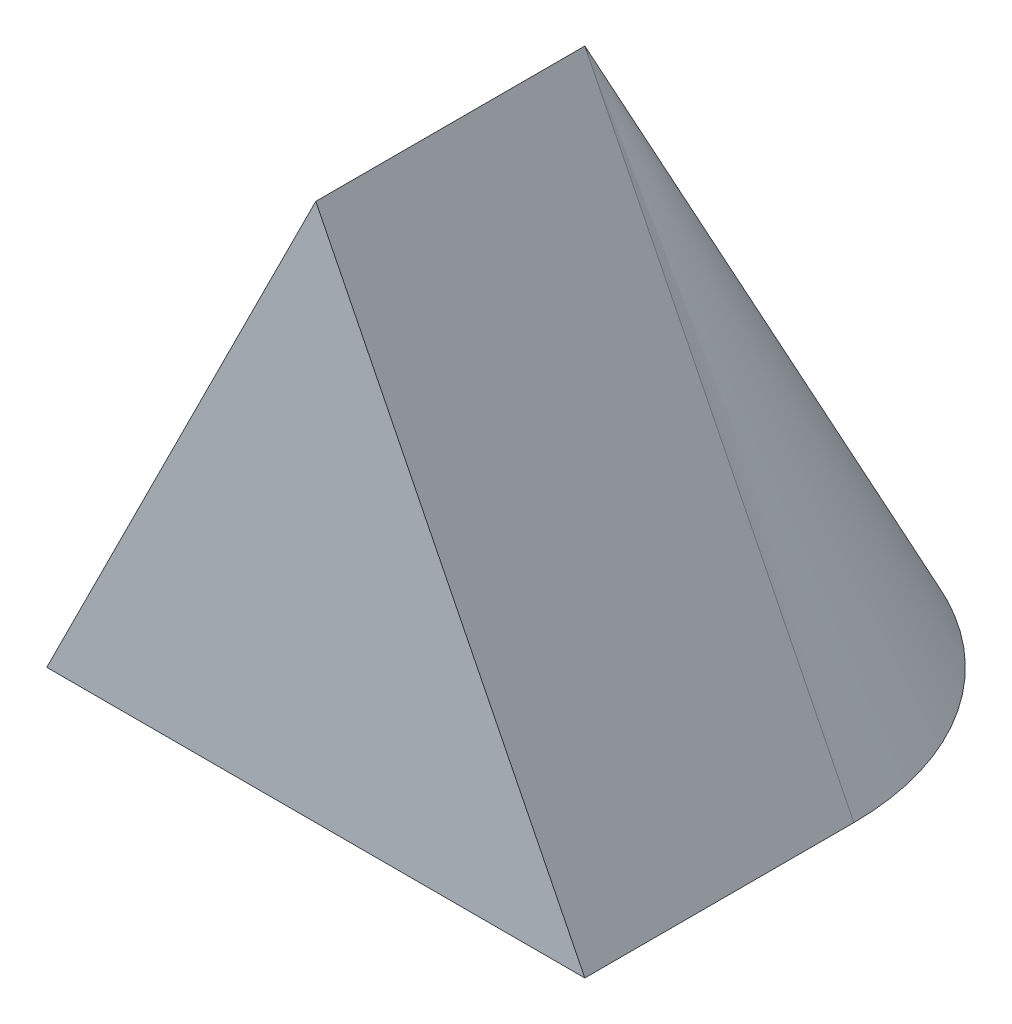
ISO-10303-21;
HEADER;
FILE_DESCRIPTION(('STEP AP214'),'2;1');
FILE_NAME('part.step','',(''),(''),'','','');
FILE_SCHEMA(('AUTOMOTIVE_DESIGN { 1 0 10303 214 1 1 1 1 }'));
ENDSEC;
DATA;
#1=APPLICATION_CONTEXT('core data for automotive mechanical design processes');
#2=APPLICATION_PROTOCOL_DEFINITION('international standard','automotive_design',2000,#1);
#3=PRODUCT_CONTEXT('',#1,'mechanical');
#4=PRODUCT('Part','Part','',(#3));
#5=PRODUCT_RELATED_PRODUCT_CATEGORY('part','',(#4));
#6=PRODUCT_DEFINITION_FORMATION('','',#4);
#7=PRODUCT_DEFINITION_CONTEXT('part definition',#1,'design');
#8=PRODUCT_DEFINITION('design','',#6,#7);
#9=PRODUCT_DEFINITION_SHAPE('','',#8);
#10=(LENGTH_UNIT() NAMED_UNIT(*) SI_UNIT(.MILLI.,.METRE.));
#11=(NAMED_UNIT(*) PLANE_ANGLE_UNIT() SI_UNIT($,.RADIAN.));
#12=(NAMED_UNIT(*) SI_UNIT($,.STERADIAN.) SOLID_ANGLE_UNIT());
#13=UNCERTAINTY_MEASURE_WITH_UNIT(LENGTH_MEASURE(1.E-05),#10,'distance_accuracy_value','');
#14=(GEOMETRIC_REPRESENTATION_CONTEXT(3) GLOBAL_UNCERTAINTY_ASSIGNED_CONTEXT((#13)) GLOBAL_UNIT_ASSIGNED_CONTEXT((#10,
#11,#12)) REPRESENTATION_CONTEXT('',''));
#15=CARTESIAN_POINT('',(0.,0.,0.));
#16=DIRECTION('',(0.,0.,1.));
#17=DIRECTION('',(1.,0.,0.));
#18=AXIS2_PLACEMENT_3D('',#15,#16,#17);
#19=CARTESIAN_POINT('',(0.,136.525,0.));
#20=DIRECTION('',(0.,-1.,0.));
#21=DIRECTION('',(0.,0.,-1.));
#22=AXIS2_PLACEMENT_3D('',#19,#20,#21);
#23=CONICAL_SURFACE('',#22,0.,0.463647609000806);
#24=CARTESIAN_POINT('',(0.,-66.675,0.));
#25=DIRECTION('',(0.,1.,0.));
#26=DIRECTION('',(0.,0.,1.));
#27=AXIS2_PLACEMENT_3D('',#24,#25,#26);
#28=CIRCLE('',#27,101.6);
#29=CARTESIAN_POINT('',(101.6,-66.675,0.));
#30=VERTEX_POINT('',#29);
#31=CARTESIAN_POINT('',(-101.6,-66.675,0.));
#32=VERTEX_POINT('',#31);
#33=EDGE_CURVE('E11',#30,#32,#28,.T.);
#34=ORIENTED_EDGE('',*,*,#33,.T.);
#35=DIRECTION('',(-0.447213595499958,-0.894427190999916,0.));
#36=VECTOR('',#35,1.);
#37=CARTESIAN_POINT('',(0.,136.525,0.));
#38=LINE('',#37,#36);
#39=CARTESIAN_POINT('',(0.,136.525,0.));
#40=VERTEX_POINT('',#39);
#41=EDGE_CURVE('E87',#40,#32,#38,.T.);
#42=ORIENTED_EDGE('',*,*,#41,.F.);
#43=DIRECTION('',(0.447213595499958,-0.894427190999916,0.));
#44=VECTOR('',#43,1.);
#45=CARTESIAN_POINT('',(0.,136.525,0.));
#46=LINE('',#45,#44);
#47=EDGE_CURVE('E45',#40,#30,#46,.T.);
#48=ORIENTED_EDGE('',*,*,#47,.T.);
#49=EDGE_LOOP('',(#34,#42,#48));
#50=FACE_BOUND('',#49,.T.);
#51=ADVANCED_FACE('F38',(#50),#23,.T.);
#52=CARTESIAN_POINT('',(101.6,-66.675,7.09469008052925E-13));
#53=DIRECTION('',(0.,-1.,0.));
#54=DIRECTION('',(0.,0.,-1.));
#55=AXIS2_PLACEMENT_3D('',#52,#53,#54);
#56=PLANE('',#55);
#57=ORIENTED_EDGE('',*,*,#33,.F.);
#58=DIRECTION('',(0.,0.,-1.));
#59=VECTOR('',#58,1.);
#60=CARTESIAN_POINT('',(101.6,-66.675,101.6));
#61=LINE('',#60,#59);
#62=CARTESIAN_POINT('',(101.6,-66.675,101.6));
#63=VERTEX_POINT('',#62);
#64=EDGE_CURVE('E73',#63,#30,#61,.T.);
#65=ORIENTED_EDGE('',*,*,#64,.F.);
#66=DIRECTION('',(1.,0.,0.));
#67=VECTOR('',#66,1.);
#68=CARTESIAN_POINT('',(-101.6,-66.675,101.6));
#69=LINE('',#68,#67);
#70=CARTESIAN_POINT('',(-101.6,-66.675,101.6));
#71=VERTEX_POINT('',#70);
#72=EDGE_CURVE('E60',#71,#63,#69,.T.);
#73=ORIENTED_EDGE('',*,*,#72,.F.);
#74=DIRECTION('',(0.,0.,-1.));
#75=VECTOR('',#74,1.);
#76=CARTESIAN_POINT('',(-101.6,-66.675,101.6));
#77=LINE('',#76,#75);
#78=EDGE_CURVE('E52',#71,#32,#77,.T.);
#79=ORIENTED_EDGE('',*,*,#78,.T.);
#80=EDGE_LOOP('',(#57,#65,#73,#79));
#81=FACE_BOUND('',#80,.T.);
#82=ADVANCED_FACE('F93',(#81),#56,.T.);
#83=CARTESIAN_POINT('',(101.6,-66.675,101.6));
#84=DIRECTION('',(-0.894427190999916,-0.447213595499958,0.));
#85=DIRECTION('',(0.447213595499958,-0.894427190999916,0.));
#86=AXIS2_PLACEMENT_3D('',#83,#84,#85);
#87=PLANE('',#86);
#88=ORIENTED_EDGE('',*,*,#47,.F.);
#89=DIRECTION('',(0.,0.,-1.));
#90=VECTOR('',#89,1.);
#91=CARTESIAN_POINT('',(0.,136.525,101.6));
#92=LINE('',#91,#90);
#93=CARTESIAN_POINT('',(0.,136.525,101.6));
#94=VERTEX_POINT('',#93);
#95=EDGE_CURVE('E79',#94,#40,#92,.T.);
#96=ORIENTED_EDGE('',*,*,#95,.F.);
#97=DIRECTION('',(-0.447213595499958,0.894427190999916,0.));
#98=VECTOR('',#97,1.);
#99=CARTESIAN_POINT('',(101.6,-66.675,101.6));
#100=LINE('',#99,#98);
#101=EDGE_CURVE('E80',#63,#94,#100,.T.);
#102=ORIENTED_EDGE('',*,*,#101,.F.);
#103=ORIENTED_EDGE('',*,*,#64,.T.);
#104=EDGE_LOOP('',(#88,#96,#102,#103));
#105=FACE_BOUND('',#104,.T.);
#106=ADVANCED_FACE('F84',(#105),#87,.F.);
#107=CARTESIAN_POINT('',(0.,136.525,101.6));
#108=DIRECTION('',(0.894427190999916,-0.447213595499958,0.));
#109=DIRECTION('',(0.447213595499958,0.894427190999916,0.));
#110=AXIS2_PLACEMENT_3D('',#107,#108,#109);
#111=PLANE('',#110);
#112=ORIENTED_EDGE('',*,*,#41,.T.);
#113=ORIENTED_EDGE('',*,*,#78,.F.);
#114=DIRECTION('',(-0.447213595499958,-0.894427190999916,0.));
#115=VECTOR('',#114,1.);
#116=CARTESIAN_POINT('',(0.,136.525,101.6));
#117=LINE('',#116,#115);
#118=EDGE_CURVE('E76',#94,#71,#117,.T.);
#119=ORIENTED_EDGE('',*,*,#118,.F.);
#120=ORIENTED_EDGE('',*,*,#95,.T.);
#121=EDGE_LOOP('',(#112,#113,#119,#120));
#122=FACE_BOUND('',#121,.T.);
#123=ADVANCED_FACE('F77',(#122),#111,.F.);
#124=CARTESIAN_POINT('',(0.,0.,101.6));
#125=DIRECTION('',(0.,0.,-1.));
#126=DIRECTION('',(-1.,0.,0.));
#127=AXIS2_PLACEMENT_3D('',#124,#125,#126);
#128=PLANE('',#127);
#129=ORIENTED_EDGE('',*,*,#101,.T.);
#130=ORIENTED_EDGE('',*,*,#118,.T.);
#131=ORIENTED_EDGE('',*,*,#72,.T.);
#132=EDGE_LOOP('',(#129,#130,#131));
#133=FACE_BOUND('',#132,.T.);
#134=ADVANCED_FACE('F82',(#133),#128,.F.);
#135=CLOSED_SHELL('',(#51,#82,#106,#123,#134));
#136=MANIFOLD_SOLID_BREP('B2',#135);
#137=ADVANCED_BREP_SHAPE_REPRESENTATION('',(#18,#136),#14);
#138=SHAPE_DEFINITION_REPRESENTATION(#9,#137);
ENDSEC;
END-ISO-10303-21;
